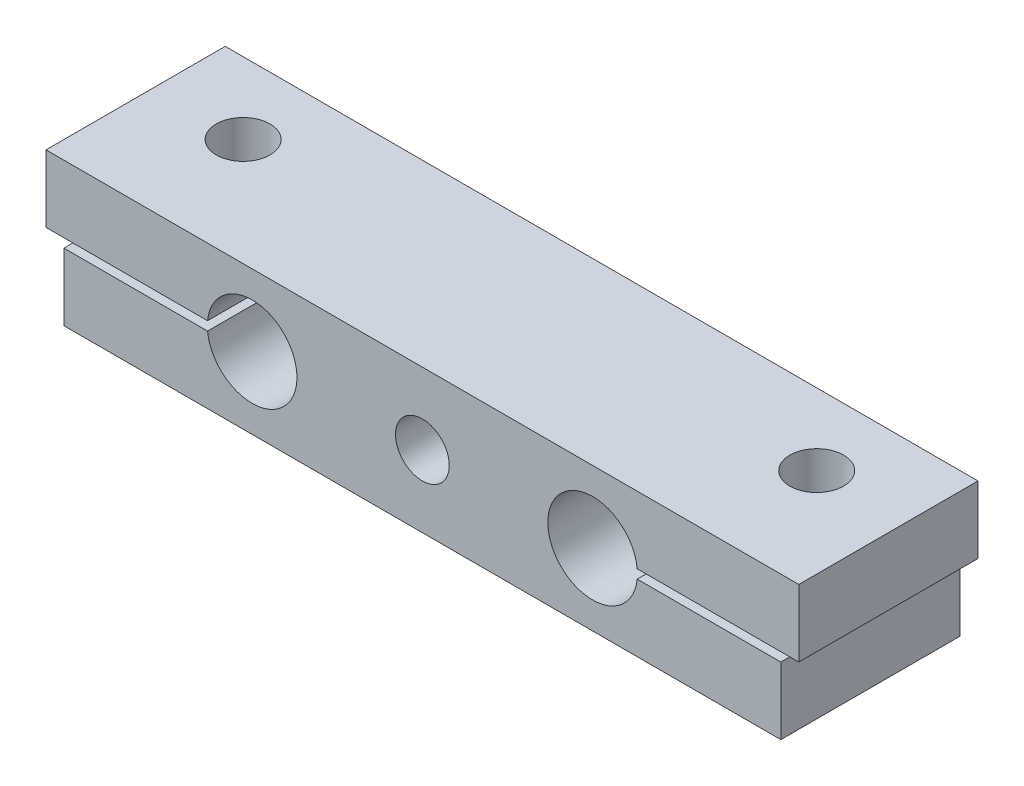
ISO-10303-21;
HEADER;
FILE_DESCRIPTION(('STEP AP214'),'2;1');
FILE_NAME('part.step','',(''),(''),'','','');
FILE_SCHEMA(('AUTOMOTIVE_DESIGN { 1 0 10303 214 1 1 1 1 }'));
ENDSEC;
DATA;
#1=APPLICATION_CONTEXT('core data for automotive mechanical design processes');
#2=APPLICATION_PROTOCOL_DEFINITION('international standard','automotive_design',2000,#1);
#3=PRODUCT_CONTEXT('',#1,'mechanical');
#4=PRODUCT('Part','Part','',(#3));
#5=PRODUCT_RELATED_PRODUCT_CATEGORY('part','',(#4));
#6=PRODUCT_DEFINITION_FORMATION('','',#4);
#7=PRODUCT_DEFINITION_CONTEXT('part definition',#1,'design');
#8=PRODUCT_DEFINITION('design','',#6,#7);
#9=PRODUCT_DEFINITION_SHAPE('','',#8);
#10=(LENGTH_UNIT() NAMED_UNIT(*) SI_UNIT(.MILLI.,.METRE.));
#11=(NAMED_UNIT(*) PLANE_ANGLE_UNIT() SI_UNIT($,.RADIAN.));
#12=(NAMED_UNIT(*) SI_UNIT($,.STERADIAN.) SOLID_ANGLE_UNIT());
#13=UNCERTAINTY_MEASURE_WITH_UNIT(LENGTH_MEASURE(1.E-05),#10,'distance_accuracy_value','');
#14=(GEOMETRIC_REPRESENTATION_CONTEXT(3) GLOBAL_UNCERTAINTY_ASSIGNED_CONTEXT((#13)) GLOBAL_UNIT_ASSIGNED_CONTEXT((#10,
#11,#12)) REPRESENTATION_CONTEXT('',''));
#15=CARTESIAN_POINT('',(0.,0.,0.));
#16=DIRECTION('',(0.,0.,1.));
#17=DIRECTION('',(1.,0.,0.));
#18=AXIS2_PLACEMENT_3D('',#15,#16,#17);
#19=CARTESIAN_POINT('',(-19.9977368673645,0.250000000000001,10.));
#20=DIRECTION('',(0.,1.,0.));
#21=DIRECTION('',(-1.,0.,0.));
#22=AXIS2_PLACEMENT_3D('',#19,#20,#21);
#23=PLANE('',#22);
#24=CARTESIAN_POINT('',(-16.,0.250000000000001,4.));
#25=DIRECTION('',(0.,1.,0.));
#26=DIRECTION('',(0.,0.,1.));
#27=AXIS2_PLACEMENT_3D('',#24,#25,#26);
#28=CIRCLE('',#27,1.5);
#29=CARTESIAN_POINT('',(-16.,0.250000000000001,5.5));
#30=VERTEX_POINT('',#29);
#31=EDGE_CURVE('E326',#30,#30,#28,.T.);
#32=ORIENTED_EDGE('',*,*,#31,.T.);
#33=EDGE_LOOP('',(#32));
#34=FACE_BOUND('',#33,.T.);
#35=DIRECTION('',(1.,0.,0.));
#36=VECTOR('',#35,1.);
#37=CARTESIAN_POINT('',(-19.9977368673645,0.250000000000001,0.));
#38=LINE('',#37,#36);
#39=CARTESIAN_POINT('',(-20.9977368673645,0.250000000000001,0.));
#40=VERTEX_POINT('',#39);
#41=CARTESIAN_POINT('',(-11.9852054601311,0.250000000000001,0.));
#42=VERTEX_POINT('',#41);
#43=EDGE_CURVE('E99',#40,#42,#38,.T.);
#44=ORIENTED_EDGE('',*,*,#43,.T.);
#45=DIRECTION('',(0.,0.,-1.));
#46=VECTOR('',#45,1.);
#47=CARTESIAN_POINT('',(-11.9852054601311,0.250000000000001,10.));
#48=LINE('',#47,#46);
#49=CARTESIAN_POINT('',(-11.9852054601311,0.250000000000001,10.));
#50=VERTEX_POINT('',#49);
#51=EDGE_CURVE('E11',#50,#42,#48,.T.);
#52=ORIENTED_EDGE('',*,*,#51,.F.);
#53=DIRECTION('',(1.,0.,0.));
#54=VECTOR('',#53,1.);
#55=CARTESIAN_POINT('',(-20.9977368673645,0.250000000000001,10.));
#56=LINE('',#55,#54);
#57=CARTESIAN_POINT('',(-20.9977368673645,0.250000000000001,10.));
#58=VERTEX_POINT('',#57);
#59=EDGE_CURVE('E105',#58,#50,#56,.T.);
#60=ORIENTED_EDGE('',*,*,#59,.F.);
#61=DIRECTION('',(0.,0.,-1.));
#62=VECTOR('',#61,1.);
#63=CARTESIAN_POINT('',(-20.9977368673645,0.250000000000001,10.));
#64=LINE('',#63,#62);
#65=EDGE_CURVE('E152',#58,#40,#64,.T.);
#66=ORIENTED_EDGE('',*,*,#65,.T.);
#67=EDGE_LOOP('',(#44,#52,#60,#66));
#68=FACE_BOUND('',#67,.T.);
#69=ADVANCED_FACE('F36',(#34,#68),#23,.F.);
#70=CARTESIAN_POINT('',(-9.49773686736451,0.,10.));
#71=DIRECTION('',(0.,0.,-1.));
#72=DIRECTION('',(-1.,0.,0.));
#73=AXIS2_PLACEMENT_3D('',#70,#71,#72);
#74=CYLINDRICAL_SURFACE('',#73,2.5);
#75=CARTESIAN_POINT('',(-9.49773686736451,0.,0.));
#76=DIRECTION('',(0.,0.,-1.));
#77=DIRECTION('',(1.,0.,0.));
#78=AXIS2_PLACEMENT_3D('',#75,#76,#77);
#79=CIRCLE('',#78,2.5);
#80=CARTESIAN_POINT('',(-11.9852054601311,-0.249999999999999,0.));
#81=VERTEX_POINT('',#80);
#82=EDGE_CURVE('E157',#42,#81,#79,.T.);
#83=ORIENTED_EDGE('',*,*,#82,.T.);
#84=DIRECTION('',(0.,0.,-1.));
#85=VECTOR('',#84,1.);
#86=CARTESIAN_POINT('',(-11.9852054601311,-0.249999999999999,10.));
#87=LINE('',#86,#85);
#88=CARTESIAN_POINT('',(-11.9852054601311,-0.249999999999999,10.));
#89=VERTEX_POINT('',#88);
#90=EDGE_CURVE('E44',#89,#81,#87,.T.);
#91=ORIENTED_EDGE('',*,*,#90,.F.);
#92=CARTESIAN_POINT('',(-9.49773686736451,0.,10.));
#93=DIRECTION('',(0.,0.,-1.));
#94=DIRECTION('',(1.,0.,0.));
#95=AXIS2_PLACEMENT_3D('',#92,#93,#94);
#96=CIRCLE('',#95,2.5);
#97=EDGE_CURVE('E246',#50,#89,#96,.T.);
#98=ORIENTED_EDGE('',*,*,#97,.F.);
#99=ORIENTED_EDGE('',*,*,#51,.T.);
#100=EDGE_LOOP('',(#83,#91,#98,#99));
#101=FACE_BOUND('',#100,.T.);
#102=ADVANCED_FACE('F251',(#101),#74,.F.);
#103=CARTESIAN_POINT('',(-11.9852054601311,-0.249999999999999,10.));
#104=DIRECTION('',(0.,-1.,0.));
#105=DIRECTION('',(1.,0.,0.));
#106=AXIS2_PLACEMENT_3D('',#103,#104,#105);
#107=PLANE('',#106);
#108=CARTESIAN_POINT('',(-16.,-0.250000000000001,4.));
#109=DIRECTION('',(0.,-1.,0.));
#110=DIRECTION('',(1.,0.,0.));
#111=AXIS2_PLACEMENT_3D('',#108,#109,#110);
#112=CIRCLE('',#111,1.24999999999999);
#113=CARTESIAN_POINT('',(-14.75,-0.25,4.));
#114=VERTEX_POINT('',#113);
#115=EDGE_CURVE('E338',#114,#114,#112,.T.);
#116=ORIENTED_EDGE('',*,*,#115,.T.);
#117=EDGE_LOOP('',(#116));
#118=FACE_BOUND('',#117,.T.);
#119=DIRECTION('',(-1.,0.,0.));
#120=VECTOR('',#119,1.);
#121=CARTESIAN_POINT('',(-11.9852054601311,-0.249999999999999,0.));
#122=LINE('',#121,#120);
#123=CARTESIAN_POINT('',(-20.,-0.250000000000003,0.));
#124=VERTEX_POINT('',#123);
#125=EDGE_CURVE('E160',#81,#124,#122,.T.);
#126=ORIENTED_EDGE('',*,*,#125,.T.);
#127=DIRECTION('',(0.,0.,-1.));
#128=VECTOR('',#127,1.);
#129=CARTESIAN_POINT('',(-20.,-0.250000000000003,10.));
#130=LINE('',#129,#128);
#131=CARTESIAN_POINT('',(-20.,-0.250000000000003,10.));
#132=VERTEX_POINT('',#131);
#133=EDGE_CURVE('E198',#132,#124,#130,.T.);
#134=ORIENTED_EDGE('',*,*,#133,.F.);
#135=DIRECTION('',(-1.,0.,0.));
#136=VECTOR('',#135,1.);
#137=CARTESIAN_POINT('',(-11.9852054601311,-0.249999999999999,10.));
#138=LINE('',#137,#136);
#139=EDGE_CURVE('E207',#89,#132,#138,.T.);
#140=ORIENTED_EDGE('',*,*,#139,.F.);
#141=ORIENTED_EDGE('',*,*,#90,.T.);
#142=EDGE_LOOP('',(#126,#134,#140,#141));
#143=FACE_BOUND('',#142,.T.);
#144=ADVANCED_FACE('F205',(#118,#143),#107,.F.);
#145=CARTESIAN_POINT('',(-20.,-0.250000000000003,10.));
#146=DIRECTION('',(0.999999817892681,0.000603501951979392,0.));
#147=DIRECTION('',(-0.000603501951979392,0.99999981789268,0.));
#148=AXIS2_PLACEMENT_3D('',#145,#146,#147);
#149=PLANE('',#148);
#150=DIRECTION('',(0.000603501951979392,-0.999999817892681,0.));
#151=VECTOR('',#150,1.);
#152=CARTESIAN_POINT('',(-20.,-0.250000000000003,0.));
#153=LINE('',#152,#151);
#154=CARTESIAN_POINT('',(-19.9977368673645,-3.99999983996516,0.));
#155=VERTEX_POINT('',#154);
#156=EDGE_CURVE('E162',#124,#155,#153,.T.);
#157=ORIENTED_EDGE('',*,*,#156,.T.);
#158=DIRECTION('',(0.,0.,-1.));
#159=VECTOR('',#158,1.);
#160=CARTESIAN_POINT('',(-19.9977368673645,-3.99999983996516,10.));
#161=LINE('',#160,#159);
#162=CARTESIAN_POINT('',(-19.9977368673645,-3.99999983996516,10.));
#163=VERTEX_POINT('',#162);
#164=EDGE_CURVE('E195',#163,#155,#161,.T.);
#165=ORIENTED_EDGE('',*,*,#164,.F.);
#166=DIRECTION('',(0.000603501951979392,-0.999999817892681,0.));
#167=VECTOR('',#166,1.);
#168=CARTESIAN_POINT('',(-20.,-0.250000000000003,10.));
#169=LINE('',#168,#167);
#170=EDGE_CURVE('E225',#132,#163,#169,.T.);
#171=ORIENTED_EDGE('',*,*,#170,.F.);
#172=ORIENTED_EDGE('',*,*,#133,.T.);
#173=EDGE_LOOP('',(#157,#165,#171,#172));
#174=FACE_BOUND('',#173,.T.);
#175=ADVANCED_FACE('F216',(#174),#149,.F.);
#176=CARTESIAN_POINT('',(19.9977368673645,-3.99999983996515,10.));
#177=DIRECTION('',(0.,1.,0.));
#178=DIRECTION('',(-1.,0.,0.));
#179=AXIS2_PLACEMENT_3D('',#176,#177,#178);
#180=PLANE('',#179);
#181=CARTESIAN_POINT('',(-16.,-3.99999983996516,4.));
#182=DIRECTION('',(0.,-1.,0.));
#183=DIRECTION('',(0.,0.,-1.));
#184=AXIS2_PLACEMENT_3D('',#181,#182,#183);
#185=CIRCLE('',#184,1.24999999999999);
#186=CARTESIAN_POINT('',(-16.,-3.99999983996516,2.75000000000001));
#187=VERTEX_POINT('',#186);
#188=EDGE_CURVE('E335',#187,#187,#185,.T.);
#189=ORIENTED_EDGE('',*,*,#188,.F.);
#190=EDGE_LOOP('',(#189));
#191=FACE_BOUND('',#190,.T.);
#192=CARTESIAN_POINT('',(16.,-3.99999983996515,4.));
#193=DIRECTION('',(0.,-1.,0.));
#194=DIRECTION('',(0.,0.,-1.));
#195=AXIS2_PLACEMENT_3D('',#192,#193,#194);
#196=CIRCLE('',#195,1.24999999999999);
#197=CARTESIAN_POINT('',(16.,-3.99999983996515,2.75000000000001));
#198=VERTEX_POINT('',#197);
#199=EDGE_CURVE('E340',#198,#198,#196,.T.);
#200=ORIENTED_EDGE('',*,*,#199,.F.);
#201=EDGE_LOOP('',(#200));
#202=FACE_BOUND('',#201,.T.);
#203=DIRECTION('',(1.,0.,0.));
#204=VECTOR('',#203,1.);
#205=CARTESIAN_POINT('',(19.9977368673645,-3.99999983996515,0.));
#206=LINE('',#205,#204);
#207=CARTESIAN_POINT('',(19.9977368673645,-3.99999983996515,0.));
#208=VERTEX_POINT('',#207);
#209=EDGE_CURVE('E164',#155,#208,#206,.T.);
#210=ORIENTED_EDGE('',*,*,#209,.T.);
#211=DIRECTION('',(0.,0.,-1.));
#212=VECTOR('',#211,1.);
#213=CARTESIAN_POINT('',(19.9977368673645,-3.99999983996515,10.));
#214=LINE('',#213,#212);
#215=CARTESIAN_POINT('',(19.9977368673645,-3.99999983996515,10.));
#216=VERTEX_POINT('',#215);
#217=EDGE_CURVE('E192',#216,#208,#214,.T.);
#218=ORIENTED_EDGE('',*,*,#217,.F.);
#219=DIRECTION('',(1.,0.,0.));
#220=VECTOR('',#219,1.);
#221=CARTESIAN_POINT('',(19.9977368673645,-3.99999983996515,10.));
#222=LINE('',#221,#220);
#223=EDGE_CURVE('E222',#163,#216,#222,.T.);
#224=ORIENTED_EDGE('',*,*,#223,.F.);
#225=ORIENTED_EDGE('',*,*,#164,.T.);
#226=EDGE_LOOP('',(#210,#218,#224,#225));
#227=FACE_BOUND('',#226,.T.);
#228=ADVANCED_FACE('F220',(#191,#202,#227),#180,.F.);
#229=CARTESIAN_POINT('',(19.9977368673645,-3.99999983996515,10.));
#230=DIRECTION('',(-1.,0.,0.));
#231=DIRECTION('',(0.,0.,1.));
#232=AXIS2_PLACEMENT_3D('',#229,#230,#231);
#233=PLANE('',#232);
#234=DIRECTION('',(0.,1.,0.));
#235=VECTOR('',#234,1.);
#236=CARTESIAN_POINT('',(19.9977368673645,-3.99999983996515,0.));
#237=LINE('',#236,#235);
#238=CARTESIAN_POINT('',(19.9977368673645,-0.249999999999999,0.));
#239=VERTEX_POINT('',#238);
#240=EDGE_CURVE('E166',#208,#239,#237,.T.);
#241=ORIENTED_EDGE('',*,*,#240,.T.);
#242=DIRECTION('',(0.,0.,-1.));
#243=VECTOR('',#242,1.);
#244=CARTESIAN_POINT('',(19.9977368673645,-0.249999999999999,10.));
#245=LINE('',#244,#243);
#246=CARTESIAN_POINT('',(19.9977368673645,-0.249999999999999,10.));
#247=VERTEX_POINT('',#246);
#248=EDGE_CURVE('E189',#247,#239,#245,.T.);
#249=ORIENTED_EDGE('',*,*,#248,.F.);
#250=DIRECTION('',(0.,1.,0.));
#251=VECTOR('',#250,1.);
#252=CARTESIAN_POINT('',(19.9977368673645,-3.99999983996515,10.));
#253=LINE('',#252,#251);
#254=EDGE_CURVE('E224',#216,#247,#253,.T.);
#255=ORIENTED_EDGE('',*,*,#254,.F.);
#256=ORIENTED_EDGE('',*,*,#217,.T.);
#257=EDGE_LOOP('',(#241,#249,#255,#256));
#258=FACE_BOUND('',#257,.T.);
#259=ADVANCED_FACE('F265',(#258),#233,.F.);
#260=CARTESIAN_POINT('',(19.9977368673645,-0.249999999999999,10.));
#261=DIRECTION('',(0.,-1.,0.));
#262=DIRECTION('',(0.,0.,-1.));
#263=AXIS2_PLACEMENT_3D('',#260,#261,#262);
#264=PLANE('',#263);
#265=CARTESIAN_POINT('',(16.,-0.249999999999999,4.));
#266=DIRECTION('',(0.,-1.,0.));
#267=DIRECTION('',(0.,0.,-1.));
#268=AXIS2_PLACEMENT_3D('',#265,#266,#267);
#269=CIRCLE('',#268,1.24999999999999);
#270=CARTESIAN_POINT('',(16.,-0.249999999999999,2.75000000000001));
#271=VERTEX_POINT('',#270);
#272=EDGE_CURVE('E158',#271,#271,#269,.T.);
#273=ORIENTED_EDGE('',*,*,#272,.T.);
#274=EDGE_LOOP('',(#273));
#275=FACE_BOUND('',#274,.T.);
#276=DIRECTION('',(-1.,0.,0.));
#277=VECTOR('',#276,1.);
#278=CARTESIAN_POINT('',(19.9977368673645,-0.249999999999999,0.));
#279=LINE('',#278,#277);
#280=CARTESIAN_POINT('',(11.9852054601311,-0.249999999999999,0.));
#281=VERTEX_POINT('',#280);
#282=EDGE_CURVE('E168',#239,#281,#279,.T.);
#283=ORIENTED_EDGE('',*,*,#282,.T.);
#284=DIRECTION('',(0.,0.,-1.));
#285=VECTOR('',#284,1.);
#286=CARTESIAN_POINT('',(11.9852054601311,-0.249999999999999,10.));
#287=LINE('',#286,#285);
#288=CARTESIAN_POINT('',(11.9852054601311,-0.249999999999999,10.));
#289=VERTEX_POINT('',#288);
#290=EDGE_CURVE('E186',#289,#281,#287,.T.);
#291=ORIENTED_EDGE('',*,*,#290,.F.);
#292=DIRECTION('',(-1.,0.,0.));
#293=VECTOR('',#292,1.);
#294=CARTESIAN_POINT('',(19.9977368673645,-0.249999999999999,10.));
#295=LINE('',#294,#293);
#296=EDGE_CURVE('E227',#247,#289,#295,.T.);
#297=ORIENTED_EDGE('',*,*,#296,.F.);
#298=ORIENTED_EDGE('',*,*,#248,.T.);
#299=EDGE_LOOP('',(#283,#291,#297,#298));
#300=FACE_BOUND('',#299,.T.);
#301=ADVANCED_FACE('F269',(#275,#300),#264,.F.);
#302=CARTESIAN_POINT('',(9.49773686736451,0.,10.));
#303=DIRECTION('',(0.,0.,-1.));
#304=DIRECTION('',(-1.,0.,0.));
#305=AXIS2_PLACEMENT_3D('',#302,#303,#304);
#306=CYLINDRICAL_SURFACE('',#305,2.5);
#307=CARTESIAN_POINT('',(9.49773686736451,0.,0.));
#308=DIRECTION('',(0.,0.,-1.));
#309=DIRECTION('',(1.,0.,0.));
#310=AXIS2_PLACEMENT_3D('',#307,#308,#309);
#311=CIRCLE('',#310,2.5);
#312=CARTESIAN_POINT('',(11.9852054601311,0.250000000000001,0.));
#313=VERTEX_POINT('',#312);
#314=EDGE_CURVE('E170',#281,#313,#311,.T.);
#315=ORIENTED_EDGE('',*,*,#314,.T.);
#316=DIRECTION('',(0.,0.,-1.));
#317=VECTOR('',#316,1.);
#318=CARTESIAN_POINT('',(11.9852054601311,0.250000000000001,10.));
#319=LINE('',#318,#317);
#320=CARTESIAN_POINT('',(11.9852054601311,0.250000000000001,10.));
#321=VERTEX_POINT('',#320);
#322=EDGE_CURVE('E183',#321,#313,#319,.T.);
#323=ORIENTED_EDGE('',*,*,#322,.F.);
#324=CARTESIAN_POINT('',(9.49773686736451,0.,10.));
#325=DIRECTION('',(0.,0.,-1.));
#326=DIRECTION('',(1.,0.,0.));
#327=AXIS2_PLACEMENT_3D('',#324,#325,#326);
#328=CIRCLE('',#327,2.5);
#329=EDGE_CURVE('E233',#289,#321,#328,.T.);
#330=ORIENTED_EDGE('',*,*,#329,.F.);
#331=ORIENTED_EDGE('',*,*,#290,.T.);
#332=EDGE_LOOP('',(#315,#323,#330,#331));
#333=FACE_BOUND('',#332,.T.);
#334=ADVANCED_FACE('F239',(#333),#306,.F.);
#335=CARTESIAN_POINT('',(20.9977368673645,0.250000000000001,10.));
#336=DIRECTION('',(0.,1.,0.));
#337=DIRECTION('',(0.,0.,1.));
#338=AXIS2_PLACEMENT_3D('',#335,#336,#337);
#339=PLANE('',#338);
#340=CARTESIAN_POINT('',(16.,0.250000000000001,4.));
#341=DIRECTION('',(0.,1.,0.));
#342=DIRECTION('',(0.,0.,1.));
#343=AXIS2_PLACEMENT_3D('',#340,#341,#342);
#344=CIRCLE('',#343,1.49999999999999);
#345=CARTESIAN_POINT('',(16.,0.250000000000001,5.49999999999999));
#346=VERTEX_POINT('',#345);
#347=EDGE_CURVE('E316',#346,#346,#344,.F.);
#348=ORIENTED_EDGE('',*,*,#347,.F.);
#349=EDGE_LOOP('',(#348));
#350=FACE_BOUND('',#349,.T.);
#351=DIRECTION('',(1.,0.,0.));
#352=VECTOR('',#351,1.);
#353=CARTESIAN_POINT('',(20.9977368673645,0.250000000000001,0.));
#354=LINE('',#353,#352);
#355=CARTESIAN_POINT('',(20.9977368673645,0.250000000000001,0.));
#356=VERTEX_POINT('',#355);
#357=EDGE_CURVE('E173',#313,#356,#354,.T.);
#358=ORIENTED_EDGE('',*,*,#357,.T.);
#359=DIRECTION('',(0.,0.,-1.));
#360=VECTOR('',#359,1.);
#361=CARTESIAN_POINT('',(20.9977368673645,0.250000000000001,10.));
#362=LINE('',#361,#360);
#363=CARTESIAN_POINT('',(20.9977368673645,0.250000000000001,10.));
#364=VERTEX_POINT('',#363);
#365=EDGE_CURVE('E147',#364,#356,#362,.T.);
#366=ORIENTED_EDGE('',*,*,#365,.F.);
#367=DIRECTION('',(1.,0.,0.));
#368=VECTOR('',#367,1.);
#369=CARTESIAN_POINT('',(19.9977368673645,0.250000000000001,10.));
#370=LINE('',#369,#368);
#371=EDGE_CURVE('E137',#321,#364,#370,.T.);
#372=ORIENTED_EDGE('',*,*,#371,.F.);
#373=ORIENTED_EDGE('',*,*,#322,.T.);
#374=EDGE_LOOP('',(#358,#366,#372,#373));
#375=FACE_BOUND('',#374,.T.);
#376=ADVANCED_FACE('F242',(#350,#375),#339,.F.);
#377=CARTESIAN_POINT('',(20.9977368673645,3.99999983996516,10.));
#378=DIRECTION('',(-1.,0.,0.));
#379=DIRECTION('',(0.,0.,1.));
#380=AXIS2_PLACEMENT_3D('',#377,#378,#379);
#381=PLANE('',#380);
#382=DIRECTION('',(0.,1.,0.));
#383=VECTOR('',#382,1.);
#384=CARTESIAN_POINT('',(20.9977368673645,3.99999983996516,0.));
#385=LINE('',#384,#383);
#386=CARTESIAN_POINT('',(20.9977368673645,3.99999983996516,0.));
#387=VERTEX_POINT('',#386);
#388=EDGE_CURVE('E146',#356,#387,#385,.T.);
#389=ORIENTED_EDGE('',*,*,#388,.T.);
#390=DIRECTION('',(0.,0.,-1.));
#391=VECTOR('',#390,1.);
#392=CARTESIAN_POINT('',(20.9977368673645,3.99999983996516,10.));
#393=LINE('',#392,#391);
#394=CARTESIAN_POINT('',(20.9977368673645,3.99999983996516,10.));
#395=VERTEX_POINT('',#394);
#396=EDGE_CURVE('E143',#395,#387,#393,.T.);
#397=ORIENTED_EDGE('',*,*,#396,.F.);
#398=DIRECTION('',(0.,1.,0.));
#399=VECTOR('',#398,1.);
#400=CARTESIAN_POINT('',(20.9977368673645,3.99999983996516,10.));
#401=LINE('',#400,#399);
#402=EDGE_CURVE('E131',#364,#395,#401,.T.);
#403=ORIENTED_EDGE('',*,*,#402,.F.);
#404=ORIENTED_EDGE('',*,*,#365,.T.);
#405=EDGE_LOOP('',(#389,#397,#403,#404));
#406=FACE_BOUND('',#405,.T.);
#407=ADVANCED_FACE('F144',(#406),#381,.F.);
#408=CARTESIAN_POINT('',(-19.9977368673645,3.99999983996515,10.));
#409=DIRECTION('',(0.,-1.,0.));
#410=DIRECTION('',(0.,0.,-1.));
#411=AXIS2_PLACEMENT_3D('',#408,#409,#410);
#412=PLANE('',#411);
#413=CARTESIAN_POINT('',(16.,3.99999983996516,4.));
#414=DIRECTION('',(0.,1.,0.));
#415=DIRECTION('',(0.,0.,1.));
#416=AXIS2_PLACEMENT_3D('',#413,#414,#415);
#417=CIRCLE('',#416,1.49999999999999);
#418=CARTESIAN_POINT('',(16.,3.99999983996516,5.49999999999999));
#419=VERTEX_POINT('',#418);
#420=EDGE_CURVE('E319',#419,#419,#417,.T.);
#421=ORIENTED_EDGE('',*,*,#420,.F.);
#422=EDGE_LOOP('',(#421));
#423=FACE_BOUND('',#422,.T.);
#424=CARTESIAN_POINT('',(-16.,3.99999983996515,4.));
#425=DIRECTION('',(0.,1.,0.));
#426=DIRECTION('',(0.,0.,1.));
#427=AXIS2_PLACEMENT_3D('',#424,#425,#426);
#428=CIRCLE('',#427,1.49999999999999);
#429=CARTESIAN_POINT('',(-16.,3.99999983996515,5.49999999999999));
#430=VERTEX_POINT('',#429);
#431=EDGE_CURVE('E321',#430,#430,#428,.T.);
#432=ORIENTED_EDGE('',*,*,#431,.F.);
#433=EDGE_LOOP('',(#432));
#434=FACE_BOUND('',#433,.T.);
#435=DIRECTION('',(-1.,0.,0.));
#436=VECTOR('',#435,1.);
#437=CARTESIAN_POINT('',(-19.9977368673645,3.99999983996515,0.));
#438=LINE('',#437,#436);
#439=CARTESIAN_POINT('',(-20.9977368673645,3.99999983996515,0.));
#440=VERTEX_POINT('',#439);
#441=EDGE_CURVE('E92',#387,#440,#438,.T.);
#442=ORIENTED_EDGE('',*,*,#441,.T.);
#443=DIRECTION('',(0.,0.,-1.));
#444=VECTOR('',#443,1.);
#445=CARTESIAN_POINT('',(-20.9977368673645,3.99999983996515,10.));
#446=LINE('',#445,#444);
#447=CARTESIAN_POINT('',(-20.9977368673645,3.99999983996515,10.));
#448=VERTEX_POINT('',#447);
#449=EDGE_CURVE('E148',#448,#440,#446,.T.);
#450=ORIENTED_EDGE('',*,*,#449,.F.);
#451=DIRECTION('',(-1.,0.,0.));
#452=VECTOR('',#451,1.);
#453=CARTESIAN_POINT('',(20.0022631326355,3.99999983996516,10.));
#454=LINE('',#453,#452);
#455=EDGE_CURVE('E135',#395,#448,#454,.T.);
#456=ORIENTED_EDGE('',*,*,#455,.F.);
#457=ORIENTED_EDGE('',*,*,#396,.T.);
#458=EDGE_LOOP('',(#442,#450,#456,#457));
#459=FACE_BOUND('',#458,.T.);
#460=ADVANCED_FACE('F150',(#423,#434,#459),#412,.F.);
#461=CARTESIAN_POINT('',(-20.9977368673645,3.99999983996515,10.));
#462=DIRECTION('',(1.,0.,0.));
#463=DIRECTION('',(0.,0.,-1.));
#464=AXIS2_PLACEMENT_3D('',#461,#462,#463);
#465=PLANE('',#464);
#466=DIRECTION('',(0.,-1.,0.));
#467=VECTOR('',#466,1.);
#468=CARTESIAN_POINT('',(-20.9977368673645,3.99999983996515,0.));
#469=LINE('',#468,#467);
#470=EDGE_CURVE('E177',#440,#40,#469,.T.);
#471=ORIENTED_EDGE('',*,*,#470,.T.);
#472=ORIENTED_EDGE('',*,*,#65,.F.);
#473=DIRECTION('',(0.,-1.,0.));
#474=VECTOR('',#473,1.);
#475=CARTESIAN_POINT('',(-20.9977368673645,3.99999983996515,10.));
#476=LINE('',#475,#474);
#477=EDGE_CURVE('E52',#448,#58,#476,.T.);
#478=ORIENTED_EDGE('',*,*,#477,.F.);
#479=ORIENTED_EDGE('',*,*,#449,.T.);
#480=EDGE_LOOP('',(#471,#472,#478,#479));
#481=FACE_BOUND('',#480,.T.);
#482=ADVANCED_FACE('F244',(#481),#465,.F.);
#483=CARTESIAN_POINT('',(-9.49773686736451,0.,10.));
#484=DIRECTION('',(0.,0.,1.));
#485=DIRECTION('',(1.,0.,0.));
#486=AXIS2_PLACEMENT_3D('',#483,#484,#485);
#487=PLANE('',#486);
#488=CARTESIAN_POINT('',(0.,0.,10.));
#489=DIRECTION('',(0.,0.,1.));
#490=DIRECTION('',(1.,0.,0.));
#491=AXIS2_PLACEMENT_3D('',#488,#489,#490);
#492=CIRCLE('',#491,1.49999999999999);
#493=CARTESIAN_POINT('',(1.49999999999999,0.,10.));
#494=VERTEX_POINT('',#493);
#495=EDGE_CURVE('E329',#494,#494,#492,.T.);
#496=ORIENTED_EDGE('',*,*,#495,.F.);
#497=EDGE_LOOP('',(#496));
#498=FACE_BOUND('',#497,.T.);
#499=ORIENTED_EDGE('',*,*,#59,.T.);
#500=ORIENTED_EDGE('',*,*,#97,.T.);
#501=ORIENTED_EDGE('',*,*,#139,.T.);
#502=ORIENTED_EDGE('',*,*,#170,.T.);
#503=ORIENTED_EDGE('',*,*,#223,.T.);
#504=ORIENTED_EDGE('',*,*,#254,.T.);
#505=ORIENTED_EDGE('',*,*,#296,.T.);
#506=ORIENTED_EDGE('',*,*,#329,.T.);
#507=ORIENTED_EDGE('',*,*,#371,.T.);
#508=ORIENTED_EDGE('',*,*,#402,.T.);
#509=ORIENTED_EDGE('',*,*,#455,.T.);
#510=ORIENTED_EDGE('',*,*,#477,.T.);
#511=EDGE_LOOP('',(#499,#500,#501,#502,#503,#504,#505,#506,#507,#508,#509,#510));
#512=FACE_BOUND('',#511,.T.);
#513=ADVANCED_FACE('F133',(#498,#512),#487,.T.);
#514=CARTESIAN_POINT('',(-9.49773686736451,0.,0.));
#515=DIRECTION('',(0.,0.,1.));
#516=DIRECTION('',(1.,0.,0.));
#517=AXIS2_PLACEMENT_3D('',#514,#515,#516);
#518=PLANE('',#517);
#519=CARTESIAN_POINT('',(0.,0.,0.));
#520=DIRECTION('',(0.,0.,1.));
#521=DIRECTION('',(1.,0.,0.));
#522=AXIS2_PLACEMENT_3D('',#519,#520,#521);
#523=CIRCLE('',#522,1.5);
#524=CARTESIAN_POINT('',(1.5,0.,0.));
#525=VERTEX_POINT('',#524);
#526=EDGE_CURVE('E332',#525,#525,#523,.T.);
#527=ORIENTED_EDGE('',*,*,#526,.T.);
#528=EDGE_LOOP('',(#527));
#529=FACE_BOUND('',#528,.T.);
#530=ORIENTED_EDGE('',*,*,#43,.F.);
#531=ORIENTED_EDGE('',*,*,#470,.F.);
#532=ORIENTED_EDGE('',*,*,#441,.F.);
#533=ORIENTED_EDGE('',*,*,#388,.F.);
#534=ORIENTED_EDGE('',*,*,#357,.F.);
#535=ORIENTED_EDGE('',*,*,#314,.F.);
#536=ORIENTED_EDGE('',*,*,#282,.F.);
#537=ORIENTED_EDGE('',*,*,#240,.F.);
#538=ORIENTED_EDGE('',*,*,#209,.F.);
#539=ORIENTED_EDGE('',*,*,#156,.F.);
#540=ORIENTED_EDGE('',*,*,#125,.F.);
#541=ORIENTED_EDGE('',*,*,#82,.F.);
#542=EDGE_LOOP('',(#530,#531,#532,#533,#534,#535,#536,#537,#538,#539,#540,#541));
#543=FACE_BOUND('',#542,.T.);
#544=ADVANCED_FACE('F211',(#529,#543),#518,.F.);
#545=CARTESIAN_POINT('',(16.,-3.99999983996515,4.));
#546=DIRECTION('',(0.,-1.,0.));
#547=DIRECTION('',(0.,0.,-1.));
#548=AXIS2_PLACEMENT_3D('',#545,#546,#547);
#549=CYLINDRICAL_SURFACE('',#548,1.24999999999999);
#550=ORIENTED_EDGE('',*,*,#272,.F.);
#551=EDGE_LOOP('',(#550));
#552=FACE_BOUND('',#551,.T.);
#553=ORIENTED_EDGE('',*,*,#199,.T.);
#554=EDGE_LOOP('',(#553));
#555=FACE_BOUND('',#554,.T.);
#556=ADVANCED_FACE('F288',(#552,#555),#549,.F.);
#557=CARTESIAN_POINT('',(-16.,-3.99999983996516,4.));
#558=DIRECTION('',(0.,-1.,0.));
#559=DIRECTION('',(0.,0.,-1.));
#560=AXIS2_PLACEMENT_3D('',#557,#558,#559);
#561=CYLINDRICAL_SURFACE('',#560,1.24999999999999);
#562=ORIENTED_EDGE('',*,*,#115,.F.);
#563=EDGE_LOOP('',(#562));
#564=FACE_BOUND('',#563,.T.);
#565=ORIENTED_EDGE('',*,*,#188,.T.);
#566=EDGE_LOOP('',(#565));
#567=FACE_BOUND('',#566,.T.);
#568=ADVANCED_FACE('F295',(#564,#567),#561,.F.);
#569=CARTESIAN_POINT('',(0.,0.,10.));
#570=DIRECTION('',(0.,0.,1.));
#571=DIRECTION('',(1.,0.,0.));
#572=AXIS2_PLACEMENT_3D('',#569,#570,#571);
#573=CYLINDRICAL_SURFACE('',#572,1.49999999999999);
#574=ORIENTED_EDGE('',*,*,#526,.F.);
#575=EDGE_LOOP('',(#574));
#576=FACE_BOUND('',#575,.T.);
#577=ORIENTED_EDGE('',*,*,#495,.T.);
#578=EDGE_LOOP('',(#577));
#579=FACE_BOUND('',#578,.T.);
#580=ADVANCED_FACE('F299',(#576,#579),#573,.F.);
#581=CARTESIAN_POINT('',(-16.,3.99999983996515,4.));
#582=DIRECTION('',(0.,1.,0.));
#583=DIRECTION('',(0.,0.,1.));
#584=AXIS2_PLACEMENT_3D('',#581,#582,#583);
#585=CYLINDRICAL_SURFACE('',#584,1.49999999999999);
#586=ORIENTED_EDGE('',*,*,#31,.F.);
#587=EDGE_LOOP('',(#586));
#588=FACE_BOUND('',#587,.T.);
#589=ORIENTED_EDGE('',*,*,#431,.T.);
#590=EDGE_LOOP('',(#589));
#591=FACE_BOUND('',#590,.T.);
#592=ADVANCED_FACE('F303',(#588,#591),#585,.F.);
#593=CARTESIAN_POINT('',(16.,3.99999983996516,4.));
#594=DIRECTION('',(0.,1.,0.));
#595=DIRECTION('',(0.,0.,1.));
#596=AXIS2_PLACEMENT_3D('',#593,#594,#595);
#597=CYLINDRICAL_SURFACE('',#596,1.49999999999999);
#598=ORIENTED_EDGE('',*,*,#347,.T.);
#599=EDGE_LOOP('',(#598));
#600=FACE_BOUND('',#599,.T.);
#601=ORIENTED_EDGE('',*,*,#420,.T.);
#602=EDGE_LOOP('',(#601));
#603=FACE_BOUND('',#602,.T.);
#604=ADVANCED_FACE('F307',(#600,#603),#597,.F.);
#605=CLOSED_SHELL('',(#69,#102,#144,#175,#228,#259,#301,#334,#376,#407,#460,#482,#513,#544,#556,
#568,#580,#592,#604));
#606=MANIFOLD_SOLID_BREP('B2',#605);
#607=ADVANCED_BREP_SHAPE_REPRESENTATION('',(#18,#606),#14);
#608=SHAPE_DEFINITION_REPRESENTATION(#9,#607);
ENDSEC;
END-ISO-10303-21;
